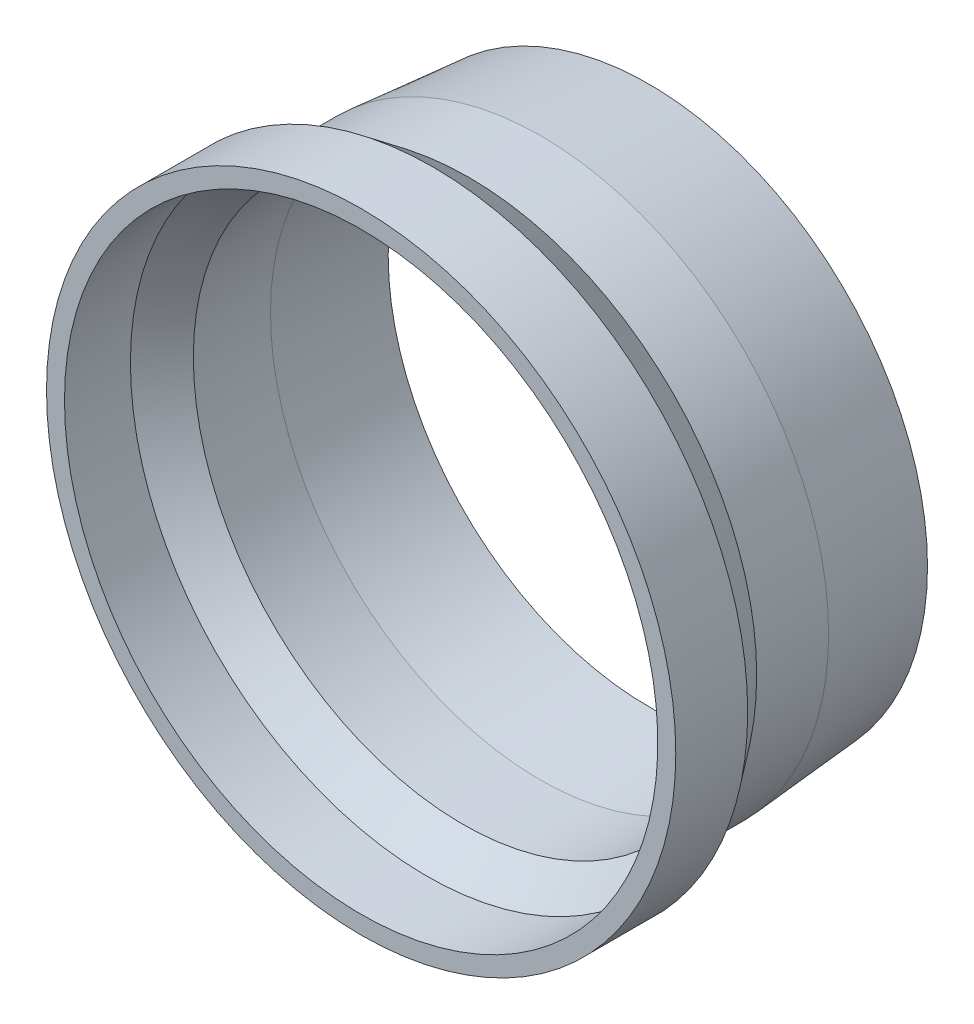
ISO-10303-21;
HEADER;
FILE_DESCRIPTION(('STEP AP214'),'2;1');
FILE_NAME('part.step','',(''),(''),'','','');
FILE_SCHEMA(('AUTOMOTIVE_DESIGN { 1 0 10303 214 1 1 1 1 }'));
ENDSEC;
DATA;
#1=APPLICATION_CONTEXT('core data for automotive mechanical design processes');
#2=APPLICATION_PROTOCOL_DEFINITION('international standard','automotive_design',2000,#1);
#3=PRODUCT_CONTEXT('',#1,'mechanical');
#4=PRODUCT('Part','Part','',(#3));
#5=PRODUCT_RELATED_PRODUCT_CATEGORY('part','',(#4));
#6=PRODUCT_DEFINITION_FORMATION('','',#4);
#7=PRODUCT_DEFINITION_CONTEXT('part definition',#1,'design');
#8=PRODUCT_DEFINITION('design','',#6,#7);
#9=PRODUCT_DEFINITION_SHAPE('','',#8);
#10=(LENGTH_UNIT() NAMED_UNIT(*) SI_UNIT(.MILLI.,.METRE.));
#11=(NAMED_UNIT(*) PLANE_ANGLE_UNIT() SI_UNIT($,.RADIAN.));
#12=(NAMED_UNIT(*) SI_UNIT($,.STERADIAN.) SOLID_ANGLE_UNIT());
#13=UNCERTAINTY_MEASURE_WITH_UNIT(LENGTH_MEASURE(1.E-05),#10,'distance_accuracy_value','');
#14=(GEOMETRIC_REPRESENTATION_CONTEXT(3) GLOBAL_UNCERTAINTY_ASSIGNED_CONTEXT((#13)) GLOBAL_UNIT_ASSIGNED_CONTEXT((#10,
#11,#12)) REPRESENTATION_CONTEXT('',''));
#15=CARTESIAN_POINT('',(0.,0.,0.));
#16=DIRECTION('',(0.,0.,1.));
#17=DIRECTION('',(1.,0.,0.));
#18=AXIS2_PLACEMENT_3D('',#15,#16,#17);
#19=CARTESIAN_POINT('',(0.,0.,0.));
#20=DIRECTION('',(0.,0.,-1.));
#21=DIRECTION('',(-1.,0.,0.));
#22=AXIS2_PLACEMENT_3D('',#19,#20,#21);
#23=CYLINDRICAL_SURFACE('',#22,52.3875);
#24=CARTESIAN_POINT('',(0.,0.,39.1583333333333));
#25=DIRECTION('',(0.,0.,-1.));
#26=DIRECTION('',(-1.,0.,0.));
#27=AXIS2_PLACEMENT_3D('',#24,#25,#26);
#28=CIRCLE('',#27,52.3875);
#29=CARTESIAN_POINT('',(-52.3875,0.,39.1583333333333));
#30=VERTEX_POINT('',#29);
#31=EDGE_CURVE('E66',#30,#30,#28,.T.);
#32=ORIENTED_EDGE('',*,*,#31,.T.);
#33=EDGE_LOOP('',(#32));
#34=FACE_BOUND('',#33,.T.);
#35=CARTESIAN_POINT('',(0.,0.,50.8));
#36=DIRECTION('',(0.,0.,-1.));
#37=DIRECTION('',(-1.,0.,0.));
#38=AXIS2_PLACEMENT_3D('',#35,#36,#37);
#39=CIRCLE('',#38,52.3875);
#40=CARTESIAN_POINT('',(-52.3875,0.,50.8));
#41=VERTEX_POINT('',#40);
#42=EDGE_CURVE('E10',#41,#41,#39,.T.);
#43=ORIENTED_EDGE('',*,*,#42,.F.);
#44=EDGE_LOOP('',(#43));
#45=FACE_BOUND('',#44,.T.);
#46=ADVANCED_FACE('F32',(#34,#45),#23,.F.);
#47=CARTESIAN_POINT('',(0.,55.5625,50.8));
#48=DIRECTION('',(0.,0.,1.));
#49=DIRECTION('',(1.,0.,0.));
#50=AXIS2_PLACEMENT_3D('',#47,#48,#49);
#51=PLANE('',#50);
#52=ORIENTED_EDGE('',*,*,#42,.T.);
#53=EDGE_LOOP('',(#52));
#54=FACE_BOUND('',#53,.T.);
#55=CARTESIAN_POINT('',(0.,0.,50.8));
#56=DIRECTION('',(0.,0.,-1.));
#57=DIRECTION('',(-1.,0.,0.));
#58=AXIS2_PLACEMENT_3D('',#55,#56,#57);
#59=CIRCLE('',#58,55.5625);
#60=CARTESIAN_POINT('',(-55.5625,0.,50.8));
#61=VERTEX_POINT('',#60);
#62=EDGE_CURVE('E38',#61,#61,#59,.T.);
#63=ORIENTED_EDGE('',*,*,#62,.F.);
#64=EDGE_LOOP('',(#63));
#65=FACE_BOUND('',#64,.T.);
#66=ADVANCED_FACE('F84',(#54,#65),#51,.T.);
#67=CARTESIAN_POINT('',(0.,0.,0.));
#68=DIRECTION('',(0.,0.,-1.));
#69=DIRECTION('',(-1.,0.,0.));
#70=AXIS2_PLACEMENT_3D('',#67,#68,#69);
#71=CYLINDRICAL_SURFACE('',#70,55.5625);
#72=ORIENTED_EDGE('',*,*,#62,.T.);
#73=EDGE_LOOP('',(#72));
#74=FACE_BOUND('',#73,.T.);
#75=CARTESIAN_POINT('',(0.,0.,38.1));
#76=DIRECTION('',(0.,0.,-1.));
#77=DIRECTION('',(-1.,0.,0.));
#78=AXIS2_PLACEMENT_3D('',#75,#76,#77);
#79=CIRCLE('',#78,55.5625);
#80=CARTESIAN_POINT('',(-55.5625,0.,38.1));
#81=VERTEX_POINT('',#80);
#82=EDGE_CURVE('E42',#81,#81,#79,.T.);
#83=ORIENTED_EDGE('',*,*,#82,.F.);
#84=EDGE_LOOP('',(#83));
#85=FACE_BOUND('',#84,.T.);
#86=ADVANCED_FACE('F88',(#74,#85),#71,.T.);
#87=CARTESIAN_POINT('',(0.,0.,31.75));
#88=DIRECTION('',(0.,0.,1.));
#89=DIRECTION('',(1.,0.,0.));
#90=AXIS2_PLACEMENT_3D('',#87,#88,#89);
#91=CONICAL_SURFACE('',#90,50.8,0.643501108793283);
#92=ORIENTED_EDGE('',*,*,#82,.T.);
#93=EDGE_LOOP('',(#92));
#94=FACE_BOUND('',#93,.T.);
#95=CARTESIAN_POINT('',(0.,0.,31.75));
#96=DIRECTION('',(0.,0.,-1.));
#97=DIRECTION('',(-1.,0.,0.));
#98=AXIS2_PLACEMENT_3D('',#95,#96,#97);
#99=CIRCLE('',#98,50.8);
#100=CARTESIAN_POINT('',(-50.8,0.,31.75));
#101=VERTEX_POINT('',#100);
#102=EDGE_CURVE('E46',#101,#101,#99,.T.);
#103=ORIENTED_EDGE('',*,*,#102,.F.);
#104=EDGE_LOOP('',(#103));
#105=FACE_BOUND('',#104,.T.);
#106=ADVANCED_FACE('F92',(#94,#105),#91,.T.);
#107=CARTESIAN_POINT('',(0.,0.,0.));
#108=DIRECTION('',(0.,0.,-1.));
#109=DIRECTION('',(-1.,0.,0.));
#110=AXIS2_PLACEMENT_3D('',#107,#108,#109);
#111=CYLINDRICAL_SURFACE('',#110,50.8);
#112=ORIENTED_EDGE('',*,*,#102,.T.);
#113=EDGE_LOOP('',(#112));
#114=FACE_BOUND('',#113,.T.);
#115=CARTESIAN_POINT('',(0.,0.,19.05));
#116=DIRECTION('',(0.,0.,-1.));
#117=DIRECTION('',(-1.,0.,0.));
#118=AXIS2_PLACEMENT_3D('',#115,#116,#117);
#119=CIRCLE('',#118,50.8);
#120=CARTESIAN_POINT('',(-50.8,0.,19.05));
#121=VERTEX_POINT('',#120);
#122=EDGE_CURVE('E51',#121,#121,#119,.T.);
#123=ORIENTED_EDGE('',*,*,#122,.F.);
#124=EDGE_LOOP('',(#123));
#125=FACE_BOUND('',#124,.T.);
#126=ADVANCED_FACE('F98',(#114,#125),#111,.T.);
#127=CARTESIAN_POINT('',(0.,0.,0.));
#128=DIRECTION('',(0.,0.,1.));
#129=DIRECTION('',(1.,0.,0.));
#130=AXIS2_PLACEMENT_3D('',#127,#128,#129);
#131=CONICAL_SURFACE('',#130,49.2125,0.0831412318884411);
#132=ORIENTED_EDGE('',*,*,#122,.T.);
#133=EDGE_LOOP('',(#132));
#134=FACE_BOUND('',#133,.T.);
#135=CARTESIAN_POINT('',(0.,0.,0.));
#136=DIRECTION('',(0.,0.,-1.));
#137=DIRECTION('',(-1.,0.,0.));
#138=AXIS2_PLACEMENT_3D('',#135,#136,#137);
#139=CIRCLE('',#138,49.2125);
#140=CARTESIAN_POINT('',(-49.2125,0.,0.));
#141=VERTEX_POINT('',#140);
#142=EDGE_CURVE('E54',#141,#141,#139,.T.);
#143=ORIENTED_EDGE('',*,*,#142,.F.);
#144=EDGE_LOOP('',(#143));
#145=FACE_BOUND('',#144,.T.);
#146=ADVANCED_FACE('F102',(#134,#145),#131,.T.);
#147=CARTESIAN_POINT('',(0.,49.2125,0.));
#148=DIRECTION('',(0.,0.,-1.));
#149=DIRECTION('',(-1.,0.,0.));
#150=AXIS2_PLACEMENT_3D('',#147,#148,#149);
#151=PLANE('',#150);
#152=ORIENTED_EDGE('',*,*,#142,.T.);
#153=EDGE_LOOP('',(#152));
#154=FACE_BOUND('',#153,.T.);
#155=CARTESIAN_POINT('',(0.,0.,0.));
#156=DIRECTION('',(0.,0.,-1.));
#157=DIRECTION('',(-1.,0.,0.));
#158=AXIS2_PLACEMENT_3D('',#155,#156,#157);
#159=CIRCLE('',#158,46.0264947676945);
#160=CARTESIAN_POINT('',(-46.0264947676945,0.,0.));
#161=VERTEX_POINT('',#160);
#162=EDGE_CURVE('E57',#161,#161,#159,.T.);
#163=ORIENTED_EDGE('',*,*,#162,.F.);
#164=EDGE_LOOP('',(#163));
#165=FACE_BOUND('',#164,.T.);
#166=ADVANCED_FACE('F106',(#154,#165),#151,.T.);
#167=CARTESIAN_POINT('',(0.,0.,19.1820627876656));
#168=DIRECTION('',(0.,0.,1.));
#169=DIRECTION('',(1.,0.,0.));
#170=AXIS2_PLACEMENT_3D('',#167,#168,#169);
#171=CONICAL_SURFACE('',#170,47.625,0.0831412318884409);
#172=ORIENTED_EDGE('',*,*,#162,.T.);
#173=EDGE_LOOP('',(#172));
#174=FACE_BOUND('',#173,.T.);
#175=CARTESIAN_POINT('',(0.,0.,19.1820627876656));
#176=DIRECTION('',(0.,0.,-1.));
#177=DIRECTION('',(-1.,0.,0.));
#178=AXIS2_PLACEMENT_3D('',#175,#176,#177);
#179=CIRCLE('',#178,47.625);
#180=CARTESIAN_POINT('',(-47.625,0.,19.1820627876656));
#181=VERTEX_POINT('',#180);
#182=EDGE_CURVE('E60',#181,#181,#179,.T.);
#183=ORIENTED_EDGE('',*,*,#182,.F.);
#184=EDGE_LOOP('',(#183));
#185=FACE_BOUND('',#184,.T.);
#186=ADVANCED_FACE('F80',(#174,#185),#171,.F.);
#187=CARTESIAN_POINT('',(0.,0.,0.));
#188=DIRECTION('',(0.,0.,-1.));
#189=DIRECTION('',(-1.,0.,0.));
#190=AXIS2_PLACEMENT_3D('',#187,#188,#189);
#191=CYLINDRICAL_SURFACE('',#190,47.625);
#192=ORIENTED_EDGE('',*,*,#182,.T.);
#193=EDGE_LOOP('',(#192));
#194=FACE_BOUND('',#193,.T.);
#195=CARTESIAN_POINT('',(0.,0.,32.8083333333333));
#196=DIRECTION('',(0.,0.,-1.));
#197=DIRECTION('',(-1.,0.,0.));
#198=AXIS2_PLACEMENT_3D('',#195,#196,#197);
#199=CIRCLE('',#198,47.625);
#200=CARTESIAN_POINT('',(-47.625,0.,32.8083333333333));
#201=VERTEX_POINT('',#200);
#202=EDGE_CURVE('E63',#201,#201,#199,.T.);
#203=ORIENTED_EDGE('',*,*,#202,.F.);
#204=EDGE_LOOP('',(#203));
#205=FACE_BOUND('',#204,.T.);
#206=ADVANCED_FACE('F74',(#194,#205),#191,.F.);
#207=CARTESIAN_POINT('',(0.,0.,39.1583333333333));
#208=DIRECTION('',(0.,0.,1.));
#209=DIRECTION('',(1.,0.,0.));
#210=AXIS2_PLACEMENT_3D('',#207,#208,#209);
#211=CONICAL_SURFACE('',#210,52.3875,0.643501108793283);
#212=ORIENTED_EDGE('',*,*,#202,.T.);
#213=EDGE_LOOP('',(#212));
#214=FACE_BOUND('',#213,.T.);
#215=ORIENTED_EDGE('',*,*,#31,.F.);
#216=EDGE_LOOP('',(#215));
#217=FACE_BOUND('',#216,.T.);
#218=ADVANCED_FACE('F72',(#214,#217),#211,.F.);
#219=CLOSED_SHELL('',(#46,#66,#86,#106,#126,#146,#166,#186,#206,#218));
#220=MANIFOLD_SOLID_BREP('B2',#219);
#221=ADVANCED_BREP_SHAPE_REPRESENTATION('',(#18,#220),#14);
#222=SHAPE_DEFINITION_REPRESENTATION(#9,#221);
ENDSEC;
END-ISO-10303-21;
